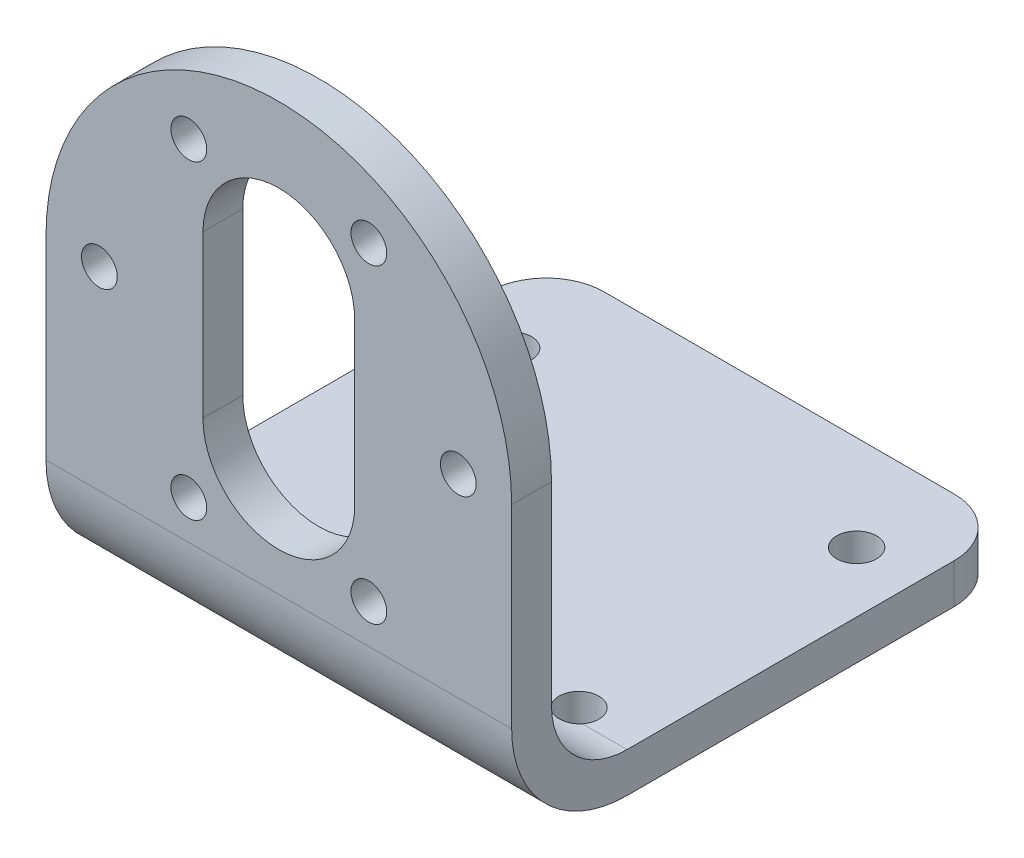
ISO-10303-21;
HEADER;
FILE_DESCRIPTION(('STEP AP214'),'2;1');
FILE_NAME('part.step','',(''),(''),'','','');
FILE_SCHEMA(('AUTOMOTIVE_DESIGN { 1 0 10303 214 1 1 1 1 }'));
ENDSEC;
DATA;
#1=APPLICATION_CONTEXT('core data for automotive mechanical design processes');
#2=APPLICATION_PROTOCOL_DEFINITION('international standard','automotive_design',2000,#1);
#3=PRODUCT_CONTEXT('',#1,'mechanical');
#4=PRODUCT('Part','Part','',(#3));
#5=PRODUCT_RELATED_PRODUCT_CATEGORY('part','',(#4));
#6=PRODUCT_DEFINITION_FORMATION('','',#4);
#7=PRODUCT_DEFINITION_CONTEXT('part definition',#1,'design');
#8=PRODUCT_DEFINITION('design','',#6,#7);
#9=PRODUCT_DEFINITION_SHAPE('','',#8);
#10=(LENGTH_UNIT() NAMED_UNIT(*) SI_UNIT(.MILLI.,.METRE.));
#11=(NAMED_UNIT(*) PLANE_ANGLE_UNIT() SI_UNIT($,.RADIAN.));
#12=(NAMED_UNIT(*) SI_UNIT($,.STERADIAN.) SOLID_ANGLE_UNIT());
#13=UNCERTAINTY_MEASURE_WITH_UNIT(LENGTH_MEASURE(1.E-05),#10,'distance_accuracy_value','');
#14=(GEOMETRIC_REPRESENTATION_CONTEXT(3) GLOBAL_UNCERTAINTY_ASSIGNED_CONTEXT((#13)) GLOBAL_UNIT_ASSIGNED_CONTEXT((#10,
#11,#12)) REPRESENTATION_CONTEXT('',''));
#15=CARTESIAN_POINT('',(0.,0.,0.));
#16=DIRECTION('',(0.,0.,1.));
#17=DIRECTION('',(1.,0.,0.));
#18=AXIS2_PLACEMENT_3D('',#15,#16,#17);
#19=CARTESIAN_POINT('',(-47.1412127925836,47.,50.783023222912));
#20=DIRECTION('',(0.,0.,-1.));
#21=DIRECTION('',(-1.,0.,0.));
#22=AXIS2_PLACEMENT_3D('',#19,#20,#21);
#23=PLANE('',#22);
#24=CARTESIAN_POINT('',(-19.1662127925836,13.3727697016443,50.783023222912));
#25=DIRECTION('',(0.,0.,1.));
#26=DIRECTION('',(1.,0.,0.));
#27=AXIS2_PLACEMENT_3D('',#24,#25,#26);
#28=CIRCLE('',#27,1.55);
#29=CARTESIAN_POINT('',(-17.6162127925836,13.3727697016443,50.783023222912));
#30=VERTEX_POINT('',#29);
#31=EDGE_CURVE('E438',#30,#30,#28,.F.);
#32=ORIENTED_EDGE('',*,*,#31,.T.);
#33=EDGE_LOOP('',(#32));
#34=FACE_BOUND('',#33,.T.);
#35=CARTESIAN_POINT('',(-42.5162127925836,26.825,50.783023222912));
#36=DIRECTION('',(0.,0.,1.));
#37=DIRECTION('',(1.,0.,0.));
#38=AXIS2_PLACEMENT_3D('',#35,#36,#37);
#39=CIRCLE('',#38,1.54999999999999);
#40=CARTESIAN_POINT('',(-40.9662127925836,26.825,50.783023222912));
#41=VERTEX_POINT('',#40);
#42=EDGE_CURVE('E435',#41,#41,#39,.T.);
#43=ORIENTED_EDGE('',*,*,#42,.F.);
#44=EDGE_LOOP('',(#43));
#45=FACE_BOUND('',#44,.T.);
#46=CARTESIAN_POINT('',(-19.1662127925836,40.2772302983557,50.783023222912));
#47=DIRECTION('',(0.,0.,1.));
#48=DIRECTION('',(1.,0.,0.));
#49=AXIS2_PLACEMENT_3D('',#46,#47,#48);
#50=CIRCLE('',#49,1.55);
#51=CARTESIAN_POINT('',(-17.6162127925836,40.2772302983557,50.783023222912));
#52=VERTEX_POINT('',#51);
#53=EDGE_CURVE('E430',#52,#52,#50,.T.);
#54=ORIENTED_EDGE('',*,*,#53,.F.);
#55=EDGE_LOOP('',(#54));
#56=FACE_BOUND('',#55,.T.);
#57=CARTESIAN_POINT('',(-34.7662127925836,13.3727697016443,50.783023222912));
#58=DIRECTION('',(0.,0.,1.));
#59=DIRECTION('',(1.,0.,0.));
#60=AXIS2_PLACEMENT_3D('',#57,#58,#59);
#61=CIRCLE('',#60,1.55);
#62=CARTESIAN_POINT('',(-33.2162127925836,13.3727697016443,50.783023222912));
#63=VERTEX_POINT('',#62);
#64=EDGE_CURVE('E268',#63,#63,#61,.F.);
#65=ORIENTED_EDGE('',*,*,#64,.T.);
#66=EDGE_LOOP('',(#65));
#67=FACE_BOUND('',#66,.T.);
#68=CARTESIAN_POINT('',(-26.9662127925836,19.945,50.783023222912));
#69=DIRECTION('',(0.,0.,1.));
#70=DIRECTION('',(1.,0.,0.));
#71=AXIS2_PLACEMENT_3D('',#68,#69,#70);
#72=CIRCLE('',#71,6.575);
#73=CARTESIAN_POINT('',(-33.5412127925836,19.945,50.783023222912));
#74=VERTEX_POINT('',#73);
#75=CARTESIAN_POINT('',(-20.3912127925836,19.945,50.783023222912));
#76=VERTEX_POINT('',#75);
#77=EDGE_CURVE('E175',#74,#76,#72,.T.);
#78=ORIENTED_EDGE('',*,*,#77,.F.);
#79=DIRECTION('',(0.,-1.,0.));
#80=VECTOR('',#79,1.);
#81=CARTESIAN_POINT('',(-33.5412127925836,0.,50.783023222912));
#82=LINE('',#81,#80);
#83=CARTESIAN_POINT('',(-33.5412127925836,33.925,50.783023222912));
#84=VERTEX_POINT('',#83);
#85=EDGE_CURVE('E53',#84,#74,#82,.T.);
#86=ORIENTED_EDGE('',*,*,#85,.F.);
#87=CARTESIAN_POINT('',(-26.9662127925836,33.925,50.783023222912));
#88=DIRECTION('',(0.,0.,1.));
#89=DIRECTION('',(1.,0.,0.));
#90=AXIS2_PLACEMENT_3D('',#87,#88,#89);
#91=CIRCLE('',#90,6.57500000000001);
#92=CARTESIAN_POINT('',(-20.3912127925836,33.925,50.783023222912));
#93=VERTEX_POINT('',#92);
#94=EDGE_CURVE('E181',#93,#84,#91,.T.);
#95=ORIENTED_EDGE('',*,*,#94,.F.);
#96=DIRECTION('',(0.,-1.,0.));
#97=VECTOR('',#96,1.);
#98=CARTESIAN_POINT('',(-20.3912127925836,0.,50.783023222912));
#99=LINE('',#98,#97);
#100=EDGE_CURVE('E166',#93,#76,#99,.T.);
#101=ORIENTED_EDGE('',*,*,#100,.T.);
#102=EDGE_LOOP('',(#78,#86,#95,#101));
#103=FACE_BOUND('',#102,.T.);
#104=DIRECTION('',(0.,-1.,0.));
#105=VECTOR('',#104,1.);
#106=CARTESIAN_POINT('',(-47.1412127925836,47.,50.783023222912));
#107=LINE('',#106,#105);
#108=CARTESIAN_POINT('',(-47.1412127925836,26.825,50.783023222912));
#109=VERTEX_POINT('',#108);
#110=CARTESIAN_POINT('',(-47.1412127925836,10.,50.783023222912));
#111=VERTEX_POINT('',#110);
#112=EDGE_CURVE('E326',#109,#111,#107,.T.);
#113=ORIENTED_EDGE('',*,*,#112,.T.);
#114=DIRECTION('',(1.,0.,0.));
#115=VECTOR('',#114,1.);
#116=CARTESIAN_POINT('',(-47.1412127925836,10.,50.783023222912));
#117=LINE('',#116,#115);
#118=CARTESIAN_POINT('',(-6.79121279258359,10.,50.783023222912));
#119=VERTEX_POINT('',#118);
#120=EDGE_CURVE('E321',#111,#119,#117,.T.);
#121=ORIENTED_EDGE('',*,*,#120,.T.);
#122=DIRECTION('',(0.,-1.,0.));
#123=VECTOR('',#122,1.);
#124=CARTESIAN_POINT('',(-6.79121279258359,47.,50.783023222912));
#125=LINE('',#124,#123);
#126=CARTESIAN_POINT('',(-6.79121279258359,26.825,50.783023222912));
#127=VERTEX_POINT('',#126);
#128=EDGE_CURVE('E329',#127,#119,#125,.T.);
#129=ORIENTED_EDGE('',*,*,#128,.F.);
#130=CARTESIAN_POINT('',(-26.9662127925836,26.825,50.783023222912));
#131=DIRECTION('',(0.,0.,1.));
#132=DIRECTION('',(1.,0.,0.));
#133=AXIS2_PLACEMENT_3D('',#130,#131,#132);
#134=CIRCLE('',#133,20.175);
#135=EDGE_CURVE('E343',#127,#109,#134,.T.);
#136=ORIENTED_EDGE('',*,*,#135,.T.);
#137=EDGE_LOOP('',(#113,#121,#129,#136));
#138=FACE_BOUND('',#137,.T.);
#139=CARTESIAN_POINT('',(-34.7662127925836,40.2772302983557,50.783023222912));
#140=DIRECTION('',(0.,0.,1.));
#141=DIRECTION('',(1.,0.,0.));
#142=AXIS2_PLACEMENT_3D('',#139,#140,#141);
#143=CIRCLE('',#142,1.55);
#144=CARTESIAN_POINT('',(-33.2162127925836,40.2772302983557,50.783023222912));
#145=VERTEX_POINT('',#144);
#146=EDGE_CURVE('E432',#145,#145,#143,.T.);
#147=ORIENTED_EDGE('',*,*,#146,.F.);
#148=EDGE_LOOP('',(#147));
#149=FACE_BOUND('',#148,.T.);
#150=CARTESIAN_POINT('',(-11.4162127925836,26.825,50.783023222912));
#151=DIRECTION('',(0.,0.,1.));
#152=DIRECTION('',(1.,0.,0.));
#153=AXIS2_PLACEMENT_3D('',#150,#151,#152);
#154=CIRCLE('',#153,1.55);
#155=CARTESIAN_POINT('',(-9.8662127925836,26.825,50.783023222912));
#156=VERTEX_POINT('',#155);
#157=EDGE_CURVE('E441',#156,#156,#154,.T.);
#158=ORIENTED_EDGE('',*,*,#157,.F.);
#159=EDGE_LOOP('',(#158));
#160=FACE_BOUND('',#159,.T.);
#161=ADVANCED_FACE('F36',(#34,#45,#56,#67,#103,#138,#149,#160),#23,.F.);
#162=CARTESIAN_POINT('',(54.8587872074164,0.,47.3330232229119));
#163=DIRECTION('',(0.,0.,1.));
#164=DIRECTION('',(1.,0.,0.));
#165=AXIS2_PLACEMENT_3D('',#162,#163,#164);
#166=PLANE('',#165);
#167=CARTESIAN_POINT('',(-19.1662127925836,13.3727697016443,47.333023222912));
#168=DIRECTION('',(0.,0.,1.));
#169=DIRECTION('',(1.,0.,0.));
#170=AXIS2_PLACEMENT_3D('',#167,#168,#169);
#171=CIRCLE('',#170,1.55);
#172=CARTESIAN_POINT('',(-17.6162127925836,13.3727697016443,47.333023222912));
#173=VERTEX_POINT('',#172);
#174=EDGE_CURVE('E40',#173,#173,#171,.F.);
#175=ORIENTED_EDGE('',*,*,#174,.F.);
#176=EDGE_LOOP('',(#175));
#177=FACE_BOUND('',#176,.T.);
#178=CARTESIAN_POINT('',(-42.5162127925836,26.825,47.333023222912));
#179=DIRECTION('',(0.,0.,1.));
#180=DIRECTION('',(1.,0.,0.));
#181=AXIS2_PLACEMENT_3D('',#178,#179,#180);
#182=CIRCLE('',#181,1.54999999999999);
#183=CARTESIAN_POINT('',(-40.9662127925836,26.825,47.333023222912));
#184=VERTEX_POINT('',#183);
#185=EDGE_CURVE('E241',#184,#184,#182,.T.);
#186=ORIENTED_EDGE('',*,*,#185,.T.);
#187=EDGE_LOOP('',(#186));
#188=FACE_BOUND('',#187,.T.);
#189=CARTESIAN_POINT('',(-19.1662127925836,40.2772302983557,47.333023222912));
#190=DIRECTION('',(0.,0.,1.));
#191=DIRECTION('',(1.,0.,0.));
#192=AXIS2_PLACEMENT_3D('',#189,#190,#191);
#193=CIRCLE('',#192,1.55);
#194=CARTESIAN_POINT('',(-17.6162127925836,40.2772302983557,47.333023222912));
#195=VERTEX_POINT('',#194);
#196=EDGE_CURVE('E245',#195,#195,#193,.T.);
#197=ORIENTED_EDGE('',*,*,#196,.T.);
#198=EDGE_LOOP('',(#197));
#199=FACE_BOUND('',#198,.T.);
#200=CARTESIAN_POINT('',(-34.7662127925836,13.3727697016443,47.333023222912));
#201=DIRECTION('',(0.,0.,1.));
#202=DIRECTION('',(1.,0.,0.));
#203=AXIS2_PLACEMENT_3D('',#200,#201,#202);
#204=CIRCLE('',#203,1.55);
#205=CARTESIAN_POINT('',(-33.2162127925836,13.3727697016443,47.333023222912));
#206=VERTEX_POINT('',#205);
#207=EDGE_CURVE('E249',#206,#206,#204,.F.);
#208=ORIENTED_EDGE('',*,*,#207,.F.);
#209=EDGE_LOOP('',(#208));
#210=FACE_BOUND('',#209,.T.);
#211=CARTESIAN_POINT('',(-26.9662127925836,33.925,47.333023222912));
#212=DIRECTION('',(0.,0.,1.));
#213=DIRECTION('',(1.,0.,0.));
#214=AXIS2_PLACEMENT_3D('',#211,#212,#213);
#215=CIRCLE('',#214,6.57500000000001);
#216=CARTESIAN_POINT('',(-20.3912127925836,33.925,47.333023222912));
#217=VERTEX_POINT('',#216);
#218=CARTESIAN_POINT('',(-33.5412127925836,33.925,47.333023222912));
#219=VERTEX_POINT('',#218);
#220=EDGE_CURVE('E45',#217,#219,#215,.T.);
#221=ORIENTED_EDGE('',*,*,#220,.T.);
#222=DIRECTION('',(0.,-1.,0.));
#223=VECTOR('',#222,1.);
#224=CARTESIAN_POINT('',(-33.5412127925836,0.,47.333023222912));
#225=LINE('',#224,#223);
#226=CARTESIAN_POINT('',(-33.5412127925836,19.945,47.333023222912));
#227=VERTEX_POINT('',#226);
#228=EDGE_CURVE('E11',#219,#227,#225,.T.);
#229=ORIENTED_EDGE('',*,*,#228,.T.);
#230=CARTESIAN_POINT('',(-26.9662127925836,19.945,47.333023222912));
#231=DIRECTION('',(0.,0.,1.));
#232=DIRECTION('',(1.,0.,0.));
#233=AXIS2_PLACEMENT_3D('',#230,#231,#232);
#234=CIRCLE('',#233,6.575);
#235=CARTESIAN_POINT('',(-20.3912127925836,19.945,47.333023222912));
#236=VERTEX_POINT('',#235);
#237=EDGE_CURVE('E272',#227,#236,#234,.T.);
#238=ORIENTED_EDGE('',*,*,#237,.T.);
#239=DIRECTION('',(0.,-1.,0.));
#240=VECTOR('',#239,1.);
#241=CARTESIAN_POINT('',(-20.3912127925836,0.,47.333023222912));
#242=LINE('',#241,#240);
#243=EDGE_CURVE('E169',#217,#236,#242,.T.);
#244=ORIENTED_EDGE('',*,*,#243,.F.);
#245=EDGE_LOOP('',(#221,#229,#238,#244));
#246=FACE_BOUND('',#245,.T.);
#247=DIRECTION('',(-1.,0.,0.));
#248=VECTOR('',#247,1.);
#249=CARTESIAN_POINT('',(54.8587872074164,10.,47.3330232229119));
#250=LINE('',#249,#248);
#251=CARTESIAN_POINT('',(-6.79121279258359,10.,47.333023222912));
#252=VERTEX_POINT('',#251);
#253=CARTESIAN_POINT('',(-47.1412127925836,10.,47.333023222912));
#254=VERTEX_POINT('',#253);
#255=EDGE_CURVE('E254',#252,#254,#250,.T.);
#256=ORIENTED_EDGE('',*,*,#255,.T.);
#257=DIRECTION('',(0.,1.,0.));
#258=VECTOR('',#257,1.);
#259=CARTESIAN_POINT('',(-47.1412127925836,0.,47.333023222912));
#260=LINE('',#259,#258);
#261=CARTESIAN_POINT('',(-47.1412127925836,26.825,47.333023222912));
#262=VERTEX_POINT('',#261);
#263=EDGE_CURVE('E361',#254,#262,#260,.T.);
#264=ORIENTED_EDGE('',*,*,#263,.T.);
#265=CARTESIAN_POINT('',(-26.9662127925836,26.825,47.333023222912));
#266=DIRECTION('',(0.,0.,1.));
#267=DIRECTION('',(1.,0.,0.));
#268=AXIS2_PLACEMENT_3D('',#265,#266,#267);
#269=CIRCLE('',#268,20.175);
#270=CARTESIAN_POINT('',(-6.79121279258359,26.825,47.333023222912));
#271=VERTEX_POINT('',#270);
#272=EDGE_CURVE('E310',#262,#271,#269,.F.);
#273=ORIENTED_EDGE('',*,*,#272,.T.);
#274=DIRECTION('',(0.,1.,0.));
#275=VECTOR('',#274,1.);
#276=CARTESIAN_POINT('',(-6.7912127925836,47.,47.333023222912));
#277=LINE('',#276,#275);
#278=EDGE_CURVE('E349',#252,#271,#277,.T.);
#279=ORIENTED_EDGE('',*,*,#278,.F.);
#280=EDGE_LOOP('',(#256,#264,#273,#279));
#281=FACE_BOUND('',#280,.T.);
#282=CARTESIAN_POINT('',(-34.7662127925836,40.2772302983557,47.333023222912));
#283=DIRECTION('',(0.,0.,1.));
#284=DIRECTION('',(1.,0.,0.));
#285=AXIS2_PLACEMENT_3D('',#282,#283,#284);
#286=CIRCLE('',#285,1.55);
#287=CARTESIAN_POINT('',(-33.2162127925836,40.2772302983557,47.333023222912));
#288=VERTEX_POINT('',#287);
#289=EDGE_CURVE('E259',#288,#288,#286,.T.);
#290=ORIENTED_EDGE('',*,*,#289,.T.);
#291=EDGE_LOOP('',(#290));
#292=FACE_BOUND('',#291,.T.);
#293=CARTESIAN_POINT('',(-11.4162127925836,26.825,47.333023222912));
#294=DIRECTION('',(0.,0.,1.));
#295=DIRECTION('',(1.,0.,0.));
#296=AXIS2_PLACEMENT_3D('',#293,#294,#295);
#297=CIRCLE('',#296,1.55);
#298=CARTESIAN_POINT('',(-9.8662127925836,26.825,47.333023222912));
#299=VERTEX_POINT('',#298);
#300=EDGE_CURVE('E262',#299,#299,#297,.T.);
#301=ORIENTED_EDGE('',*,*,#300,.T.);
#302=EDGE_LOOP('',(#301));
#303=FACE_BOUND('',#302,.T.);
#304=ADVANCED_FACE('F224',(#177,#188,#199,#210,#246,#281,#292,#303),#166,.F.);
#305=CARTESIAN_POINT('',(-47.1412127925836,10.,40.783023222912));
#306=DIRECTION('',(1.,0.,0.));
#307=DIRECTION('',(0.,0.,-1.));
#308=AXIS2_PLACEMENT_3D('',#305,#306,#307);
#309=CYLINDRICAL_SURFACE('',#308,10.);
#310=DIRECTION('',(1.,0.,0.));
#311=VECTOR('',#310,1.);
#312=CARTESIAN_POINT('',(0.,0.,40.783023222912));
#313=LINE('',#312,#311);
#314=CARTESIAN_POINT('',(-43.2784362563963,0.,40.783023222912));
#315=VERTEX_POINT('',#314);
#316=CARTESIAN_POINT('',(-47.1412127925836,0.,40.783023222912));
#317=VERTEX_POINT('',#316);
#318=EDGE_CURVE('E318',#315,#317,#313,.F.);
#319=ORIENTED_EDGE('',*,*,#318,.F.);
#320=CARTESIAN_POINT('',(-43.2784362563963,0.,40.783023222912));
#321=CARTESIAN_POINT('',(-43.2486359399709,-4.4349836473621E-07,40.8214603242163));
#322=CARTESIAN_POINT('',(-43.2172287872784,0.000221662332903279,40.8586212397988));
#323=CARTESIAN_POINT('',(-43.1514043101819,0.0010186956629008,40.9301644796071));
#324=CARTESIAN_POINT('',(-43.1169872222953,0.00159359546079015,40.9645470217466));
#325=CARTESIAN_POINT('',(-43.0096338534374,0.00370689110784972,41.0630910128974));
#326=CARTESIAN_POINT('',(-42.9324984911893,0.0056344754400285,41.1227736432645));
#327=CARTESIAN_POINT('',(-42.7693296609276,0.00977993356184888,41.228345263273));
#328=CARTESIAN_POINT('',(-42.6832930344563,0.0119979104668324,41.2742293340198));
#329=CARTESIAN_POINT('',(-42.5047417406216,0.0160643864272017,41.3509225745123));
#330=CARTESIAN_POINT('',(-42.4122283105362,0.017912955792662,41.3817346145671));
#331=CARTESIAN_POINT('',(-42.2232265987625,0.0207581801391745,41.4274329016619));
#332=CARTESIAN_POINT('',(-42.12673395157,0.0217538719032161,41.4423011469684));
#333=CARTESIAN_POINT('',(-41.9326057116994,0.0226429764720122,41.4556247462691));
#334=CARTESIAN_POINT('',(-41.8349700052027,0.0225362785590523,41.4540784516805));
#335=CARTESIAN_POINT('',(-41.6415763854825,0.021247958445125,41.4346366721685));
#336=CARTESIAN_POINT('',(-41.545814678288,0.0200688027684255,41.4167787017401));
#337=CARTESIAN_POINT('',(-41.3586275956189,0.0169319205563948,41.3652693387677));
#338=CARTESIAN_POINT('',(-41.2672030897992,0.0149740386105347,41.3316147934571));
#339=CARTESIAN_POINT('',(-41.0911541003926,0.0107972095030289,41.24941231941));
#340=CARTESIAN_POINT('',(-41.0065411024623,0.0085778363148311,41.2008398734209));
#341=CARTESIAN_POINT('',(-40.8467183970987,0.00456685197800229,41.0901995387781));
#342=CARTESIAN_POINT('',(-40.7714972938275,0.0027747199777472,41.0281482605263));
#343=CARTESIAN_POINT('',(-40.6737041799865,0.00108006920567029,40.9325906426761));
#344=CARTESIAN_POINT('',(-40.6463021380582,0.000686824269006335,40.9039027447807));
#345=CARTESIAN_POINT('',(-40.5935784639084,0.000146949433395791,40.8447642573952));
#346=CARTESIAN_POINT('',(-40.5682532244093,-1.17077590246397E-07,40.8143168878988));
#347=CARTESIAN_POINT('',(-40.5439893287709,0.,40.783023222912));
#348=B_SPLINE_CURVE_WITH_KNOTS('',3,(#320,#321,#322,#323,#324,#325,#326,#327,#328,#329,#330,
#331,#332,#333,#334,#335,#336,#337,#338,#339,#340,#341,#342,#343,#344,#345,#346,#347),
.UNSPECIFIED.,.F.,.F.,(4,2,2,2,2,2,2,2,2,2,2,2,2,4),(0.,0.145817200628919,0.291622953380003,
0.5827663273497,0.874013365077776,1.1652049162671,1.45672489938087,1.74827416137905,
2.03915458593045,2.33009309068699,2.62151232879096,2.91257445855667,3.03152037022583,
3.1502550998775),.UNSPECIFIED.);
#349=CARTESIAN_POINT('',(-40.5439893287709,0.,40.783023222912));
#350=VERTEX_POINT('',#349);
#351=EDGE_CURVE('E367',#315,#350,#348,.T.);
#352=ORIENTED_EDGE('',*,*,#351,.T.);
#353=CARTESIAN_POINT('',(-13.3884362563963,0.,40.783023222912));
#354=VERTEX_POINT('',#353);
#355=EDGE_CURVE('E317',#354,#350,#313,.F.);
#356=ORIENTED_EDGE('',*,*,#355,.F.);
#357=CARTESIAN_POINT('',(-13.3884362563963,0.,40.783023222912));
#358=CARTESIAN_POINT('',(-13.3586359399709,-4.43498364004496E-07,40.8214603242163));
#359=CARTESIAN_POINT('',(-13.3272287872784,0.000221662332904452,40.8586212397988));
#360=CARTESIAN_POINT('',(-13.261404310182,0.0010186956629024,40.9301644796071));
#361=CARTESIAN_POINT('',(-13.2269872222954,0.00159359546079172,40.9645470217466));
#362=CARTESIAN_POINT('',(-13.1196338534375,0.00370689110785085,41.0630910128974));
#363=CARTESIAN_POINT('',(-13.0424984911893,0.00563447544002885,41.1227736432645));
#364=CARTESIAN_POINT('',(-12.8793296609276,0.00977993356184872,41.228345263273));
#365=CARTESIAN_POINT('',(-12.7932930344563,0.0119979104668325,41.2742293340198));
#366=CARTESIAN_POINT('',(-12.6147417406216,0.016064386427203,41.3509225745122));
#367=CARTESIAN_POINT('',(-12.5222283105362,0.0179129557926641,41.3817346145671));
#368=CARTESIAN_POINT('',(-12.3332265987625,0.0207581801391763,41.4274329016619));
#369=CARTESIAN_POINT('',(-12.23673395157,0.0217538719032167,41.4423011469684));
#370=CARTESIAN_POINT('',(-12.0426057116995,0.0226429764720127,41.4556247462691));
#371=CARTESIAN_POINT('',(-11.9449700052027,0.022536278559054,41.4540784516805));
#372=CARTESIAN_POINT('',(-11.7515763854825,0.0212479584451273,41.4346366721685));
#373=CARTESIAN_POINT('',(-11.655814678288,0.0200688027684272,41.4167787017401));
#374=CARTESIAN_POINT('',(-11.4686275956189,0.0169319205563954,41.3652693387677));
#375=CARTESIAN_POINT('',(-11.3772030897992,0.0149740386105346,41.3316147934571));
#376=CARTESIAN_POINT('',(-11.2011541003926,0.0107972095030294,41.24941231941));
#377=CARTESIAN_POINT('',(-11.1165411024623,0.00857783631483298,41.2008398734209));
#378=CARTESIAN_POINT('',(-10.9567183970987,0.00456685197800412,41.0901995387781));
#379=CARTESIAN_POINT('',(-10.8814972938275,0.00277471997774761,41.0281482605263));
#380=CARTESIAN_POINT('',(-10.7837041799865,0.00108006920567024,40.9325906426761));
#381=CARTESIAN_POINT('',(-10.7563021380582,0.00068682426900633,40.9039027447807));
#382=CARTESIAN_POINT('',(-10.7035784639084,0.000146949433395858,40.8447642573952));
#383=CARTESIAN_POINT('',(-10.6782532244093,-1.17077590163831E-07,40.8143168878988));
#384=CARTESIAN_POINT('',(-10.6539893287709,0.,40.783023222912));
#385=B_SPLINE_CURVE_WITH_KNOTS('',3,(#357,#358,#359,#360,#361,#362,#363,#364,#365,#366,#367,
#368,#369,#370,#371,#372,#373,#374,#375,#376,#377,#378,#379,#380,#381,#382,#383,#384),
.UNSPECIFIED.,.F.,.F.,(4,2,2,2,2,2,2,2,2,2,2,2,2,4),(0.,0.145817200628917,0.29162295337999,
0.582766327349691,0.874013365077768,1.16520491626709,1.45672489938085,1.74827416137904,
2.03915458593043,2.33009309068698,2.62151232879094,2.91257445855666,3.03152037022582,
3.1502550998775),.UNSPECIFIED.);
#386=CARTESIAN_POINT('',(-10.6539893287709,0.,40.783023222912));
#387=VERTEX_POINT('',#386);
#388=EDGE_CURVE('E198',#354,#387,#385,.T.);
#389=ORIENTED_EDGE('',*,*,#388,.T.);
#390=CARTESIAN_POINT('',(-6.7912127925836,0.,40.783023222912));
#391=VERTEX_POINT('',#390);
#392=EDGE_CURVE('E314',#391,#387,#313,.F.);
#393=ORIENTED_EDGE('',*,*,#392,.F.);
#394=CARTESIAN_POINT('',(-6.79121279258359,10.,40.783023222912));
#395=DIRECTION('',(-1.,0.,0.));
#396=DIRECTION('',(0.,0.,1.));
#397=AXIS2_PLACEMENT_3D('',#394,#395,#396);
#398=CIRCLE('',#397,10.);
#399=EDGE_CURVE('E319',#119,#391,#398,.F.);
#400=ORIENTED_EDGE('',*,*,#399,.F.);
#401=ORIENTED_EDGE('',*,*,#120,.F.);
#402=CARTESIAN_POINT('',(-47.1412127925836,10.,40.783023222912));
#403=DIRECTION('',(1.,0.,0.));
#404=DIRECTION('',(0.,0.,-1.));
#405=AXIS2_PLACEMENT_3D('',#402,#403,#404);
#406=CIRCLE('',#405,10.);
#407=EDGE_CURVE('E312',#317,#111,#406,.F.);
#408=ORIENTED_EDGE('',*,*,#407,.F.);
#409=EDGE_LOOP('',(#319,#352,#356,#389,#393,#400,#401,#408));
#410=FACE_BOUND('',#409,.T.);
#411=ADVANCED_FACE('F226',(#410),#309,.T.);
#412=CARTESIAN_POINT('',(54.8587872074164,10.,40.783023222912));
#413=DIRECTION('',(-1.,0.,0.));
#414=DIRECTION('',(0.,0.,1.));
#415=AXIS2_PLACEMENT_3D('',#412,#413,#414);
#416=CYLINDRICAL_SURFACE('',#415,6.55);
#417=CARTESIAN_POINT('',(-43.2784362563963,3.45,40.783023222912));
#418=CARTESIAN_POINT('',(-43.2486649030444,3.44999934867349,40.8214232101327));
#419=CARTESIAN_POINT('',(-43.2172902209575,3.45033775649313,40.8585485309627));
#420=CARTESIAN_POINT('',(-43.1515404880796,3.45155234711172,40.9300223959799));
#421=CARTESIAN_POINT('',(-43.1171657950523,3.4524284658614,40.9643712703312));
#422=CARTESIAN_POINT('',(-43.0099569119221,3.4556495514347,41.0628179147159));
#423=CARTESIAN_POINT('',(-42.9329391434865,3.45858816576504,41.1224428225017));
#424=CARTESIAN_POINT('',(-42.7700443143619,3.46491250386588,41.2279283458496));
#425=CARTESIAN_POINT('',(-42.6841653050849,3.46829832602347,41.2737859252697));
#426=CARTESIAN_POINT('',(-42.5059278443798,3.47451325501785,41.3504810031661));
#427=CARTESIAN_POINT('',(-42.4135705615224,3.47734246191005,41.3813212025926));
#428=CARTESIAN_POINT('',(-42.2247208263061,3.48170828002287,41.4271593411075));
#429=CARTESIAN_POINT('',(-42.1282182748401,3.48324152138179,41.4421160044016));
#430=CARTESIAN_POINT('',(-41.9340504787137,3.48461989976377,41.4556076068657));
#431=CARTESIAN_POINT('',(-41.8363851496024,3.48446491341682,41.4541413459035));
#432=CARTESIAN_POINT('',(-41.6432092488083,3.48251007467015,41.4348786711695));
#433=CARTESIAN_POINT('',(-41.5476901567274,3.48071871713345,41.4171665920683));
#434=CARTESIAN_POINT('',(-41.360958528036,3.47594847703818,41.3660360946161));
#435=CARTESIAN_POINT('',(-41.2697470123892,3.47296931451527,41.3326139730928));
#436=CARTESIAN_POINT('',(-41.0939340886157,3.4666029712209,41.2508939730243));
#437=CARTESIAN_POINT('',(-41.0093543826965,3.46321453608974,41.2025496178487));
#438=CARTESIAN_POINT('',(-40.8495367810102,3.45707866045226,41.0923795263331));
#439=CARTESIAN_POINT('',(-40.7742873177906,3.45433042244906,41.0305707505484));
#440=CARTESIAN_POINT('',(-40.6759167088539,3.45169993130762,40.9348709782518));
#441=CARTESIAN_POINT('',(-40.6480286032222,3.45108135877871,40.9057707295625));
#442=CARTESIAN_POINT('',(-40.5943938538111,3.45023162529874,40.8457439712088));
#443=CARTESIAN_POINT('',(-40.5686436235682,3.44999980253179,40.814820675295));
#444=CARTESIAN_POINT('',(-40.5439893287709,3.45,40.783023222912));
#445=B_SPLINE_CURVE_WITH_KNOTS('',3,(#417,#418,#419,#420,#421,#422,#423,#424,#425,#426,#427,
#428,#429,#430,#431,#432,#433,#434,#435,#436,#437,#438,#439,#440,#441,#442,#443,#444),
.UNSPECIFIED.,.F.,.F.,(4,2,2,2,2,2,2,2,2,2,2,2,2,4),(0.,0.145674126204746,0.291330903847856,
0.582167706488014,0.873068601032213,1.16391715626718,1.45551969013826,1.74714353348516,
2.03726202612376,2.32744893983427,2.61854894557612,2.90928436386592,3.03013527599317,
3.15077917208322),.UNSPECIFIED.);
#446=CARTESIAN_POINT('',(-43.2784362563963,3.44999999999999,40.783023222912));
#447=VERTEX_POINT('',#446);
#448=CARTESIAN_POINT('',(-40.5439893287709,3.44999999999999,40.783023222912));
#449=VERTEX_POINT('',#448);
#450=EDGE_CURVE('E374',#447,#449,#445,.T.);
#451=ORIENTED_EDGE('',*,*,#450,.F.);
#452=DIRECTION('',(-1.,0.,0.));
#453=VECTOR('',#452,1.);
#454=CARTESIAN_POINT('',(54.8587872074164,3.45,40.783023222912));
#455=LINE('',#454,#453);
#456=CARTESIAN_POINT('',(-47.1412127925836,3.45,40.783023222912));
#457=VERTEX_POINT('',#456);
#458=EDGE_CURVE('E354',#447,#457,#455,.T.);
#459=ORIENTED_EDGE('',*,*,#458,.T.);
#460=CARTESIAN_POINT('',(-47.1412127925836,10.,40.783023222912));
#461=DIRECTION('',(-1.,0.,0.));
#462=DIRECTION('',(0.,0.,1.));
#463=AXIS2_PLACEMENT_3D('',#460,#461,#462);
#464=CIRCLE('',#463,6.55);
#465=EDGE_CURVE('E363',#457,#254,#464,.T.);
#466=ORIENTED_EDGE('',*,*,#465,.T.);
#467=ORIENTED_EDGE('',*,*,#255,.F.);
#468=CARTESIAN_POINT('',(-6.79121279258359,10.,40.783023222912));
#469=DIRECTION('',(-1.,0.,0.));
#470=DIRECTION('',(0.,0.,1.));
#471=AXIS2_PLACEMENT_3D('',#468,#469,#470);
#472=CIRCLE('',#471,6.55);
#473=CARTESIAN_POINT('',(-6.7912127925836,3.45,40.783023222912));
#474=VERTEX_POINT('',#473);
#475=EDGE_CURVE('E307',#474,#252,#472,.T.);
#476=ORIENTED_EDGE('',*,*,#475,.F.);
#477=CARTESIAN_POINT('',(-10.6539893287709,3.44999999999999,40.783023222912));
#478=VERTEX_POINT('',#477);
#479=EDGE_CURVE('E352',#474,#478,#455,.T.);
#480=ORIENTED_EDGE('',*,*,#479,.T.);
#481=CARTESIAN_POINT('',(-13.3884362563963,3.45,40.783023222912));
#482=CARTESIAN_POINT('',(-13.3586649030444,3.44999934867349,40.8214232101327));
#483=CARTESIAN_POINT('',(-13.3272902209575,3.45033775649313,40.8585485309627));
#484=CARTESIAN_POINT('',(-13.2615404880797,3.45155234711172,40.9300223959798));
#485=CARTESIAN_POINT('',(-13.2271657950523,3.4524284658614,40.9643712703311));
#486=CARTESIAN_POINT('',(-13.1199569119221,3.4556495514347,41.0628179147159));
#487=CARTESIAN_POINT('',(-13.0429391434865,3.45858816576504,41.1224428225017));
#488=CARTESIAN_POINT('',(-12.8800443143619,3.46491250386588,41.2279283458496));
#489=CARTESIAN_POINT('',(-12.7941653050849,3.46829832602347,41.2737859252697));
#490=CARTESIAN_POINT('',(-12.6159278443798,3.47451325501785,41.3504810031661));
#491=CARTESIAN_POINT('',(-12.5235705615224,3.47734246191005,41.3813212025926));
#492=CARTESIAN_POINT('',(-12.3347208263061,3.48170828002287,41.4271593411075));
#493=CARTESIAN_POINT('',(-12.2382182748401,3.48324152138179,41.4421160044016));
#494=CARTESIAN_POINT('',(-12.0440504787137,3.48461989976377,41.4556076068657));
#495=CARTESIAN_POINT('',(-11.9463851496024,3.48446491341683,41.4541413459035));
#496=CARTESIAN_POINT('',(-11.7532092488083,3.48251007467015,41.4348786711695));
#497=CARTESIAN_POINT('',(-11.6576901567275,3.48071871713346,41.4171665920683));
#498=CARTESIAN_POINT('',(-11.470958528036,3.47594847703818,41.3660360946161));
#499=CARTESIAN_POINT('',(-11.3797470123892,3.47296931451527,41.3326139730928));
#500=CARTESIAN_POINT('',(-11.2039340886157,3.4666029712209,41.2508939730243));
#501=CARTESIAN_POINT('',(-11.1193543826966,3.46321453608974,41.2025496178487));
#502=CARTESIAN_POINT('',(-10.9595367810102,3.45707866045226,41.0923795263331));
#503=CARTESIAN_POINT('',(-10.8842873177906,3.45433042244906,41.0305707505484));
#504=CARTESIAN_POINT('',(-10.7859167088539,3.45169993130762,40.9348709782518));
#505=CARTESIAN_POINT('',(-10.7580286032222,3.45108135877871,40.9057707295625));
#506=CARTESIAN_POINT('',(-10.7043938538111,3.45023162529874,40.8457439712088));
#507=CARTESIAN_POINT('',(-10.6786436235682,3.44999980253179,40.814820675295));
#508=CARTESIAN_POINT('',(-10.6539893287709,3.45,40.783023222912));
#509=B_SPLINE_CURVE_WITH_KNOTS('',3,(#481,#482,#483,#484,#485,#486,#487,#488,#489,#490,#491,
#492,#493,#494,#495,#496,#497,#498,#499,#500,#501,#502,#503,#504,#505,#506,#507,#508),
.UNSPECIFIED.,.F.,.F.,(4,2,2,2,2,2,2,2,2,2,2,2,2,4),(0.,0.145674126204736,0.291330903847846,
0.58216770648801,0.8730686010322,1.16391715626717,1.45551969013825,1.74714353348516,
2.03726202612376,2.32744893983427,2.61854894557612,2.90928436386591,3.03013527599317,
3.15077917208322),.UNSPECIFIED.);
#510=CARTESIAN_POINT('',(-13.3884362563963,3.44999999999999,40.783023222912));
#511=VERTEX_POINT('',#510);
#512=EDGE_CURVE('E188',#511,#478,#509,.T.);
#513=ORIENTED_EDGE('',*,*,#512,.F.);
#514=EDGE_CURVE('E358',#511,#449,#455,.T.);
#515=ORIENTED_EDGE('',*,*,#514,.T.);
#516=EDGE_LOOP('',(#451,#459,#466,#467,#476,#480,#513,#515));
#517=FACE_BOUND('',#516,.T.);
#518=ADVANCED_FACE('F205',(#517),#416,.F.);
#519=CARTESIAN_POINT('',(-47.1412127925836,47.,7.43302322291196));
#520=DIRECTION('',(0.,0.,1.));
#521=DIRECTION('',(1.,0.,0.));
#522=AXIS2_PLACEMENT_3D('',#519,#520,#521);
#523=PLANE('',#522);
#524=DIRECTION('',(1.,0.,0.));
#525=VECTOR('',#524,1.);
#526=CARTESIAN_POINT('',(-47.1412127925836,3.45,7.43302322291196));
#527=LINE('',#526,#525);
#528=CARTESIAN_POINT('',(-42.1412127925836,3.45,7.43302322291196));
#529=VERTEX_POINT('',#528);
#530=CARTESIAN_POINT('',(-11.7912127925836,3.45,7.43302322291196));
#531=VERTEX_POINT('',#530);
#532=EDGE_CURVE('E346',#529,#531,#527,.T.);
#533=ORIENTED_EDGE('',*,*,#532,.T.);
#534=DIRECTION('',(0.,-1.,0.));
#535=VECTOR('',#534,1.);
#536=CARTESIAN_POINT('',(-11.7912127925836,47.,7.43302322291196));
#537=LINE('',#536,#535);
#538=CARTESIAN_POINT('',(-11.7912127925836,0.,7.43302322291196));
#539=VERTEX_POINT('',#538);
#540=EDGE_CURVE('E300',#531,#539,#537,.T.);
#541=ORIENTED_EDGE('',*,*,#540,.T.);
#542=DIRECTION('',(-1.,0.,0.));
#543=VECTOR('',#542,1.);
#544=CARTESIAN_POINT('',(-47.1412127925836,0.,7.43302322291196));
#545=LINE('',#544,#543);
#546=CARTESIAN_POINT('',(-42.1412127925836,0.,7.43302322291196));
#547=VERTEX_POINT('',#546);
#548=EDGE_CURVE('E332',#539,#547,#545,.T.);
#549=ORIENTED_EDGE('',*,*,#548,.T.);
#550=DIRECTION('',(0.,-1.,0.));
#551=VECTOR('',#550,1.);
#552=CARTESIAN_POINT('',(-42.1412127925836,47.,7.43302322291196));
#553=LINE('',#552,#551);
#554=EDGE_CURVE('E303',#547,#529,#553,.F.);
#555=ORIENTED_EDGE('',*,*,#554,.T.);
#556=EDGE_LOOP('',(#533,#541,#549,#555));
#557=FACE_BOUND('',#556,.T.);
#558=ADVANCED_FACE('F561',(#557),#523,.F.);
#559=CARTESIAN_POINT('',(-47.1412127925836,47.,7.43302322291196));
#560=DIRECTION('',(1.,0.,0.));
#561=DIRECTION('',(0.,0.,-1.));
#562=AXIS2_PLACEMENT_3D('',#559,#560,#561);
#563=PLANE('',#562);
#564=DIRECTION('',(0.,0.,1.));
#565=VECTOR('',#564,1.);
#566=CARTESIAN_POINT('',(-47.1412127925836,3.45,0.));
#567=LINE('',#566,#565);
#568=CARTESIAN_POINT('',(-47.1412127925836,3.45,12.433023222912));
#569=VERTEX_POINT('',#568);
#570=EDGE_CURVE('E355',#569,#457,#567,.T.);
#571=ORIENTED_EDGE('',*,*,#570,.F.);
#572=DIRECTION('',(0.,-1.,0.));
#573=VECTOR('',#572,1.);
#574=CARTESIAN_POINT('',(-47.1412127925836,47.,12.433023222912));
#575=LINE('',#574,#573);
#576=CARTESIAN_POINT('',(-47.1412127925836,0.,12.433023222912));
#577=VERTEX_POINT('',#576);
#578=EDGE_CURVE('E287',#569,#577,#575,.T.);
#579=ORIENTED_EDGE('',*,*,#578,.T.);
#580=DIRECTION('',(0.,0.,1.));
#581=VECTOR('',#580,1.);
#582=CARTESIAN_POINT('',(-47.1412127925836,0.,7.43302322291196));
#583=LINE('',#582,#581);
#584=EDGE_CURVE('E338',#577,#317,#583,.T.);
#585=ORIENTED_EDGE('',*,*,#584,.T.);
#586=ORIENTED_EDGE('',*,*,#407,.T.);
#587=ORIENTED_EDGE('',*,*,#112,.F.);
#588=DIRECTION('',(0.,0.,1.));
#589=VECTOR('',#588,1.);
#590=CARTESIAN_POINT('',(-47.1412127925836,26.825,-51.216976777088));
#591=LINE('',#590,#589);
#592=EDGE_CURVE('E341',#262,#109,#591,.T.);
#593=ORIENTED_EDGE('',*,*,#592,.F.);
#594=ORIENTED_EDGE('',*,*,#263,.F.);
#595=ORIENTED_EDGE('',*,*,#465,.F.);
#596=EDGE_LOOP('',(#571,#579,#585,#586,#587,#593,#594,#595));
#597=FACE_BOUND('',#596,.T.);
#598=ADVANCED_FACE('F615',(#597),#563,.F.);
#599=CARTESIAN_POINT('',(-6.7912127925836,47.,7.43302322291196));
#600=DIRECTION('',(-1.,0.,0.));
#601=DIRECTION('',(0.,0.,1.));
#602=AXIS2_PLACEMENT_3D('',#599,#600,#601);
#603=PLANE('',#602);
#604=DIRECTION('',(0.,0.,-1.));
#605=VECTOR('',#604,1.);
#606=CARTESIAN_POINT('',(-6.7912127925836,0.,7.43302322291196));
#607=LINE('',#606,#605);
#608=CARTESIAN_POINT('',(-6.7912127925836,0.,12.433023222912));
#609=VERTEX_POINT('',#608);
#610=EDGE_CURVE('E335',#391,#609,#607,.T.);
#611=ORIENTED_EDGE('',*,*,#610,.T.);
#612=DIRECTION('',(0.,-1.,0.));
#613=VECTOR('',#612,1.);
#614=CARTESIAN_POINT('',(-6.7912127925836,47.,12.433023222912));
#615=LINE('',#614,#613);
#616=CARTESIAN_POINT('',(-6.7912127925836,3.45,12.433023222912));
#617=VERTEX_POINT('',#616);
#618=EDGE_CURVE('E294',#609,#617,#615,.F.);
#619=ORIENTED_EDGE('',*,*,#618,.T.);
#620=DIRECTION('',(0.,0.,1.));
#621=VECTOR('',#620,1.);
#622=CARTESIAN_POINT('',(-6.7912127925836,3.45,7.43302322291196));
#623=LINE('',#622,#621);
#624=EDGE_CURVE('E305',#617,#474,#623,.T.);
#625=ORIENTED_EDGE('',*,*,#624,.T.);
#626=ORIENTED_EDGE('',*,*,#475,.T.);
#627=ORIENTED_EDGE('',*,*,#278,.T.);
#628=DIRECTION('',(0.,0.,1.));
#629=VECTOR('',#628,1.);
#630=CARTESIAN_POINT('',(-6.7912127925836,26.825,-51.216976777088));
#631=LINE('',#630,#629);
#632=EDGE_CURVE('E324',#271,#127,#631,.T.);
#633=ORIENTED_EDGE('',*,*,#632,.T.);
#634=ORIENTED_EDGE('',*,*,#128,.T.);
#635=ORIENTED_EDGE('',*,*,#399,.T.);
#636=EDGE_LOOP('',(#611,#619,#625,#626,#627,#633,#634,#635));
#637=FACE_BOUND('',#636,.T.);
#638=ADVANCED_FACE('F592',(#637),#603,.F.);
#639=CARTESIAN_POINT('',(0.,0.,0.));
#640=DIRECTION('',(0.,1.,0.));
#641=DIRECTION('',(0.,0.,1.));
#642=AXIS2_PLACEMENT_3D('',#639,#640,#641);
#643=PLANE('',#642);
#644=CARTESIAN_POINT('',(-41.9112127925836,0.,39.723023222912));
#645=DIRECTION('',(0.,1.,0.));
#646=DIRECTION('',(0.,0.,1.));
#647=AXIS2_PLACEMENT_3D('',#644,#645,#646);
#648=CIRCLE('',#647,1.73);
#649=EDGE_CURVE('E365',#315,#350,#648,.F.);
#650=ORIENTED_EDGE('',*,*,#649,.F.);
#651=ORIENTED_EDGE('',*,*,#318,.T.);
#652=ORIENTED_EDGE('',*,*,#584,.F.);
#653=CARTESIAN_POINT('',(-42.1412127925836,0.,12.433023222912));
#654=DIRECTION('',(0.,1.,0.));
#655=DIRECTION('',(0.,0.,1.));
#656=AXIS2_PLACEMENT_3D('',#653,#654,#655);
#657=CIRCLE('',#656,5.);
#658=EDGE_CURVE('E298',#577,#547,#657,.F.);
#659=ORIENTED_EDGE('',*,*,#658,.T.);
#660=ORIENTED_EDGE('',*,*,#548,.F.);
#661=CARTESIAN_POINT('',(-11.7912127925836,0.,12.433023222912));
#662=DIRECTION('',(0.,1.,0.));
#663=DIRECTION('',(0.,0.,1.));
#664=AXIS2_PLACEMENT_3D('',#661,#662,#663);
#665=CIRCLE('',#664,5.);
#666=EDGE_CURVE('E296',#539,#609,#665,.F.);
#667=ORIENTED_EDGE('',*,*,#666,.T.);
#668=ORIENTED_EDGE('',*,*,#610,.F.);
#669=ORIENTED_EDGE('',*,*,#392,.T.);
#670=CARTESIAN_POINT('',(-12.0212127925836,0.,39.723023222912));
#671=DIRECTION('',(0.,1.,0.));
#672=DIRECTION('',(0.,0.,1.));
#673=AXIS2_PLACEMENT_3D('',#670,#671,#672);
#674=CIRCLE('',#673,1.73);
#675=EDGE_CURVE('E285',#354,#387,#674,.F.);
#676=ORIENTED_EDGE('',*,*,#675,.F.);
#677=ORIENTED_EDGE('',*,*,#355,.T.);
#678=EDGE_LOOP('',(#650,#651,#652,#659,#660,#667,#668,#669,#676,#677));
#679=FACE_BOUND('',#678,.T.);
#680=CARTESIAN_POINT('',(-12.0212127925836,0.,15.663023222912));
#681=DIRECTION('',(0.,1.,0.));
#682=DIRECTION('',(0.,0.,1.));
#683=AXIS2_PLACEMENT_3D('',#680,#681,#682);
#684=CIRCLE('',#683,1.73);
#685=CARTESIAN_POINT('',(-12.0212127925836,0.,17.393023222912));
#686=VERTEX_POINT('',#685);
#687=EDGE_CURVE('E280',#686,#686,#684,.F.);
#688=ORIENTED_EDGE('',*,*,#687,.F.);
#689=EDGE_LOOP('',(#688));
#690=FACE_BOUND('',#689,.T.);
#691=CARTESIAN_POINT('',(-41.9112127925836,0.,15.663023222912));
#692=DIRECTION('',(0.,1.,0.));
#693=DIRECTION('',(0.,0.,1.));
#694=AXIS2_PLACEMENT_3D('',#691,#692,#693);
#695=CIRCLE('',#694,1.73);
#696=CARTESIAN_POINT('',(-41.9112127925836,0.,17.393023222912));
#697=VERTEX_POINT('',#696);
#698=EDGE_CURVE('E281',#697,#697,#695,.F.);
#699=ORIENTED_EDGE('',*,*,#698,.F.);
#700=EDGE_LOOP('',(#699));
#701=FACE_BOUND('',#700,.T.);
#702=ADVANCED_FACE('F588',(#679,#690,#701),#643,.F.);
#703=CARTESIAN_POINT('',(-26.9662127925836,26.825,-51.216976777088));
#704=DIRECTION('',(0.,0.,1.));
#705=DIRECTION('',(1.,0.,0.));
#706=AXIS2_PLACEMENT_3D('',#703,#704,#705);
#707=CYLINDRICAL_SURFACE('',#706,20.175);
#708=ORIENTED_EDGE('',*,*,#272,.F.);
#709=ORIENTED_EDGE('',*,*,#592,.T.);
#710=ORIENTED_EDGE('',*,*,#135,.F.);
#711=ORIENTED_EDGE('',*,*,#632,.F.);
#712=EDGE_LOOP('',(#708,#709,#710,#711));
#713=FACE_BOUND('',#712,.T.);
#714=ADVANCED_FACE('F222',(#713),#707,.T.);
#715=CARTESIAN_POINT('',(54.8587872074164,3.45,0.));
#716=DIRECTION('',(0.,-1.,0.));
#717=DIRECTION('',(0.,0.,-1.));
#718=AXIS2_PLACEMENT_3D('',#715,#716,#717);
#719=PLANE('',#718);
#720=CARTESIAN_POINT('',(-41.9112127925836,3.44999999999999,39.723023222912));
#721=DIRECTION('',(0.,-1.,0.));
#722=DIRECTION('',(0.,0.,-1.));
#723=AXIS2_PLACEMENT_3D('',#720,#721,#722);
#724=CIRCLE('',#723,1.73);
#725=EDGE_CURVE('E274',#449,#447,#724,.F.);
#726=ORIENTED_EDGE('',*,*,#725,.F.);
#727=ORIENTED_EDGE('',*,*,#514,.F.);
#728=CARTESIAN_POINT('',(-12.0212127925836,3.44999999999999,39.723023222912));
#729=DIRECTION('',(0.,-1.,0.));
#730=DIRECTION('',(0.,0.,-1.));
#731=AXIS2_PLACEMENT_3D('',#728,#729,#730);
#732=CIRCLE('',#731,1.73);
#733=EDGE_CURVE('E276',#478,#511,#732,.F.);
#734=ORIENTED_EDGE('',*,*,#733,.F.);
#735=ORIENTED_EDGE('',*,*,#479,.F.);
#736=ORIENTED_EDGE('',*,*,#624,.F.);
#737=CARTESIAN_POINT('',(-11.7912127925836,3.45,12.433023222912));
#738=DIRECTION('',(0.,-1.,0.));
#739=DIRECTION('',(0.,0.,-1.));
#740=AXIS2_PLACEMENT_3D('',#737,#738,#739);
#741=CIRCLE('',#740,5.);
#742=EDGE_CURVE('E290',#617,#531,#741,.F.);
#743=ORIENTED_EDGE('',*,*,#742,.T.);
#744=ORIENTED_EDGE('',*,*,#532,.F.);
#745=CARTESIAN_POINT('',(-42.1412127925836,3.45,12.433023222912));
#746=DIRECTION('',(0.,-1.,0.));
#747=DIRECTION('',(0.,0.,-1.));
#748=AXIS2_PLACEMENT_3D('',#745,#746,#747);
#749=CIRCLE('',#748,5.);
#750=EDGE_CURVE('E292',#529,#569,#749,.F.);
#751=ORIENTED_EDGE('',*,*,#750,.T.);
#752=ORIENTED_EDGE('',*,*,#570,.T.);
#753=ORIENTED_EDGE('',*,*,#458,.F.);
#754=EDGE_LOOP('',(#726,#727,#734,#735,#736,#743,#744,#751,#752,#753));
#755=FACE_BOUND('',#754,.T.);
#756=CARTESIAN_POINT('',(-12.0212127925836,3.44999999999999,15.663023222912));
#757=DIRECTION('',(0.,-1.,0.));
#758=DIRECTION('',(0.,0.,-1.));
#759=AXIS2_PLACEMENT_3D('',#756,#757,#758);
#760=CIRCLE('',#759,1.73);
#761=CARTESIAN_POINT('',(-12.0212127925836,3.44999999999999,13.933023222912));
#762=VERTEX_POINT('',#761);
#763=EDGE_CURVE('E277',#762,#762,#760,.F.);
#764=ORIENTED_EDGE('',*,*,#763,.F.);
#765=EDGE_LOOP('',(#764));
#766=FACE_BOUND('',#765,.T.);
#767=CARTESIAN_POINT('',(-41.9112127925836,3.44999999999999,15.663023222912));
#768=DIRECTION('',(0.,-1.,0.));
#769=DIRECTION('',(0.,0.,-1.));
#770=AXIS2_PLACEMENT_3D('',#767,#768,#769);
#771=CIRCLE('',#770,1.73);
#772=CARTESIAN_POINT('',(-41.9112127925836,3.44999999999999,13.933023222912));
#773=VERTEX_POINT('',#772);
#774=EDGE_CURVE('E282',#773,#773,#771,.F.);
#775=ORIENTED_EDGE('',*,*,#774,.F.);
#776=EDGE_LOOP('',(#775));
#777=FACE_BOUND('',#776,.T.);
#778=ADVANCED_FACE('F218',(#755,#766,#777),#719,.F.);
#779=CARTESIAN_POINT('',(-11.7912127925836,47.,12.433023222912));
#780=DIRECTION('',(0.,-1.,0.));
#781=DIRECTION('',(0.,0.,-1.));
#782=AXIS2_PLACEMENT_3D('',#779,#780,#781);
#783=CYLINDRICAL_SURFACE('',#782,5.);
#784=ORIENTED_EDGE('',*,*,#742,.F.);
#785=ORIENTED_EDGE('',*,*,#618,.F.);
#786=ORIENTED_EDGE('',*,*,#666,.F.);
#787=ORIENTED_EDGE('',*,*,#540,.F.);
#788=EDGE_LOOP('',(#784,#785,#786,#787));
#789=FACE_BOUND('',#788,.T.);
#790=ADVANCED_FACE('F221',(#789),#783,.T.);
#791=CARTESIAN_POINT('',(-42.1412127925836,47.,12.433023222912));
#792=DIRECTION('',(0.,-1.,0.));
#793=DIRECTION('',(0.,0.,-1.));
#794=AXIS2_PLACEMENT_3D('',#791,#792,#793);
#795=CYLINDRICAL_SURFACE('',#794,5.);
#796=ORIENTED_EDGE('',*,*,#750,.F.);
#797=ORIENTED_EDGE('',*,*,#554,.F.);
#798=ORIENTED_EDGE('',*,*,#658,.F.);
#799=ORIENTED_EDGE('',*,*,#578,.F.);
#800=EDGE_LOOP('',(#796,#797,#798,#799));
#801=FACE_BOUND('',#800,.T.);
#802=ADVANCED_FACE('F38',(#801),#795,.T.);
#803=CARTESIAN_POINT('',(-12.0212127925836,105.45,39.723023222912));
#804=DIRECTION('',(0.,-1.,0.));
#805=DIRECTION('',(0.,0.,-1.));
#806=AXIS2_PLACEMENT_3D('',#803,#804,#805);
#807=CYLINDRICAL_SURFACE('',#806,1.73);
#808=ORIENTED_EDGE('',*,*,#512,.T.);
#809=ORIENTED_EDGE('',*,*,#733,.T.);
#810=EDGE_LOOP('',(#808,#809));
#811=FACE_BOUND('',#810,.T.);
#812=ORIENTED_EDGE('',*,*,#675,.T.);
#813=ORIENTED_EDGE('',*,*,#388,.F.);
#814=EDGE_LOOP('',(#812,#813));
#815=FACE_BOUND('',#814,.T.);
#816=ADVANCED_FACE('F209',(#811,#815),#807,.F.);
#817=CARTESIAN_POINT('',(-41.9112127925836,105.45,15.663023222912));
#818=DIRECTION('',(0.,-1.,0.));
#819=DIRECTION('',(0.,0.,-1.));
#820=AXIS2_PLACEMENT_3D('',#817,#818,#819);
#821=CYLINDRICAL_SURFACE('',#820,1.73);
#822=ORIENTED_EDGE('',*,*,#774,.T.);
#823=EDGE_LOOP('',(#822));
#824=FACE_BOUND('',#823,.T.);
#825=ORIENTED_EDGE('',*,*,#698,.T.);
#826=EDGE_LOOP('',(#825));
#827=FACE_BOUND('',#826,.T.);
#828=ADVANCED_FACE('F214',(#824,#827),#821,.F.);
#829=CARTESIAN_POINT('',(-12.0212127925836,105.45,15.663023222912));
#830=DIRECTION('',(0.,-1.,0.));
#831=DIRECTION('',(0.,0.,-1.));
#832=AXIS2_PLACEMENT_3D('',#829,#830,#831);
#833=CYLINDRICAL_SURFACE('',#832,1.73);
#834=ORIENTED_EDGE('',*,*,#763,.T.);
#835=EDGE_LOOP('',(#834));
#836=FACE_BOUND('',#835,.T.);
#837=ORIENTED_EDGE('',*,*,#687,.T.);
#838=EDGE_LOOP('',(#837));
#839=FACE_BOUND('',#838,.T.);
#840=ADVANCED_FACE('F216',(#836,#839),#833,.F.);
#841=CARTESIAN_POINT('',(-41.9112127925836,105.45,39.723023222912));
#842=DIRECTION('',(0.,-1.,0.));
#843=DIRECTION('',(0.,0.,-1.));
#844=AXIS2_PLACEMENT_3D('',#841,#842,#843);
#845=CYLINDRICAL_SURFACE('',#844,1.73);
#846=ORIENTED_EDGE('',*,*,#450,.T.);
#847=ORIENTED_EDGE('',*,*,#725,.T.);
#848=EDGE_LOOP('',(#846,#847));
#849=FACE_BOUND('',#848,.T.);
#850=ORIENTED_EDGE('',*,*,#649,.T.);
#851=ORIENTED_EDGE('',*,*,#351,.F.);
#852=EDGE_LOOP('',(#850,#851));
#853=FACE_BOUND('',#852,.T.);
#854=ADVANCED_FACE('F382',(#849,#853),#845,.F.);
#855=CARTESIAN_POINT('',(-33.5412127925836,0.,-51.216976777088));
#856=DIRECTION('',(-1.,0.,0.));
#857=DIRECTION('',(0.,-1.,0.));
#858=AXIS2_PLACEMENT_3D('',#855,#856,#857);
#859=PLANE('',#858);
#860=DIRECTION('',(0.,0.,1.));
#861=VECTOR('',#860,1.);
#862=CARTESIAN_POINT('',(-33.5412127925836,33.925,-51.216976777088));
#863=LINE('',#862,#861);
#864=EDGE_CURVE('E186',#219,#84,#863,.T.);
#865=ORIENTED_EDGE('',*,*,#864,.T.);
#866=ORIENTED_EDGE('',*,*,#85,.T.);
#867=DIRECTION('',(0.,0.,1.));
#868=VECTOR('',#867,1.);
#869=CARTESIAN_POINT('',(-33.5412127925836,19.945,-51.216976777088));
#870=LINE('',#869,#868);
#871=EDGE_CURVE('E172',#227,#74,#870,.T.);
#872=ORIENTED_EDGE('',*,*,#871,.F.);
#873=ORIENTED_EDGE('',*,*,#228,.F.);
#874=EDGE_LOOP('',(#865,#866,#872,#873));
#875=FACE_BOUND('',#874,.T.);
#876=ADVANCED_FACE('F386',(#875),#859,.F.);
#877=CARTESIAN_POINT('',(-26.9662127925836,33.925,-51.216976777088));
#878=DIRECTION('',(0.,0.,1.));
#879=DIRECTION('',(1.,0.,0.));
#880=AXIS2_PLACEMENT_3D('',#877,#878,#879);
#881=CYLINDRICAL_SURFACE('',#880,6.57500000000001);
#882=DIRECTION('',(0.,0.,1.));
#883=VECTOR('',#882,1.);
#884=CARTESIAN_POINT('',(-20.3912127925836,33.925,-51.216976777088));
#885=LINE('',#884,#883);
#886=EDGE_CURVE('E171',#217,#93,#885,.T.);
#887=ORIENTED_EDGE('',*,*,#886,.T.);
#888=ORIENTED_EDGE('',*,*,#94,.T.);
#889=ORIENTED_EDGE('',*,*,#864,.F.);
#890=ORIENTED_EDGE('',*,*,#220,.F.);
#891=EDGE_LOOP('',(#887,#888,#889,#890));
#892=FACE_BOUND('',#891,.T.);
#893=ADVANCED_FACE('F394',(#892),#881,.F.);
#894=CARTESIAN_POINT('',(-20.3912127925836,0.,-51.216976777088));
#895=DIRECTION('',(-1.,0.,0.));
#896=DIRECTION('',(0.,-1.,0.));
#897=AXIS2_PLACEMENT_3D('',#894,#895,#896);
#898=PLANE('',#897);
#899=ORIENTED_EDGE('',*,*,#243,.T.);
#900=DIRECTION('',(0.,0.,1.));
#901=VECTOR('',#900,1.);
#902=CARTESIAN_POINT('',(-20.3912127925836,19.945,-51.216976777088));
#903=LINE('',#902,#901);
#904=EDGE_CURVE('E61',#236,#76,#903,.T.);
#905=ORIENTED_EDGE('',*,*,#904,.T.);
#906=ORIENTED_EDGE('',*,*,#100,.F.);
#907=ORIENTED_EDGE('',*,*,#886,.F.);
#908=EDGE_LOOP('',(#899,#905,#906,#907));
#909=FACE_BOUND('',#908,.T.);
#910=ADVANCED_FACE('F163',(#909),#898,.T.);
#911=CARTESIAN_POINT('',(-26.9662127925836,19.945,-51.216976777088));
#912=DIRECTION('',(0.,0.,1.));
#913=DIRECTION('',(1.,0.,0.));
#914=AXIS2_PLACEMENT_3D('',#911,#912,#913);
#915=CYLINDRICAL_SURFACE('',#914,6.575);
#916=ORIENTED_EDGE('',*,*,#871,.T.);
#917=ORIENTED_EDGE('',*,*,#77,.T.);
#918=ORIENTED_EDGE('',*,*,#904,.F.);
#919=ORIENTED_EDGE('',*,*,#237,.F.);
#920=EDGE_LOOP('',(#916,#917,#918,#919));
#921=FACE_BOUND('',#920,.T.);
#922=ADVANCED_FACE('F176',(#921),#915,.F.);
#923=CARTESIAN_POINT('',(-34.7662127925836,13.3727697016443,-51.216976777088));
#924=DIRECTION('',(0.,0.,1.));
#925=DIRECTION('',(1.,0.,0.));
#926=AXIS2_PLACEMENT_3D('',#923,#924,#925);
#927=CYLINDRICAL_SURFACE('',#926,1.55);
#928=ORIENTED_EDGE('',*,*,#64,.F.);
#929=EDGE_LOOP('',(#928));
#930=FACE_BOUND('',#929,.T.);
#931=ORIENTED_EDGE('',*,*,#207,.T.);
#932=EDGE_LOOP('',(#931));
#933=FACE_BOUND('',#932,.T.);
#934=ADVANCED_FACE('F397',(#930,#933),#927,.F.);
#935=CARTESIAN_POINT('',(-19.1662127925836,40.2772302983557,-51.216976777088));
#936=DIRECTION('',(0.,0.,1.));
#937=DIRECTION('',(1.,0.,0.));
#938=AXIS2_PLACEMENT_3D('',#935,#936,#937);
#939=CYLINDRICAL_SURFACE('',#938,1.55);
#940=ORIENTED_EDGE('',*,*,#53,.T.);
#941=EDGE_LOOP('',(#940));
#942=FACE_BOUND('',#941,.T.);
#943=ORIENTED_EDGE('',*,*,#196,.F.);
#944=EDGE_LOOP('',(#943));
#945=FACE_BOUND('',#944,.T.);
#946=ADVANCED_FACE('F405',(#942,#945),#939,.F.);
#947=CARTESIAN_POINT('',(-34.7662127925836,40.2772302983557,-51.216976777088));
#948=DIRECTION('',(0.,0.,1.));
#949=DIRECTION('',(1.,0.,0.));
#950=AXIS2_PLACEMENT_3D('',#947,#948,#949);
#951=CYLINDRICAL_SURFACE('',#950,1.55);
#952=ORIENTED_EDGE('',*,*,#146,.T.);
#953=EDGE_LOOP('',(#952));
#954=FACE_BOUND('',#953,.T.);
#955=ORIENTED_EDGE('',*,*,#289,.F.);
#956=EDGE_LOOP('',(#955));
#957=FACE_BOUND('',#956,.T.);
#958=ADVANCED_FACE('F407',(#954,#957),#951,.F.);
#959=CARTESIAN_POINT('',(-42.5162127925836,26.825,-51.216976777088));
#960=DIRECTION('',(0.,0.,1.));
#961=DIRECTION('',(1.,0.,0.));
#962=AXIS2_PLACEMENT_3D('',#959,#960,#961);
#963=CYLINDRICAL_SURFACE('',#962,1.54999999999999);
#964=ORIENTED_EDGE('',*,*,#42,.T.);
#965=EDGE_LOOP('',(#964));
#966=FACE_BOUND('',#965,.T.);
#967=ORIENTED_EDGE('',*,*,#185,.F.);
#968=EDGE_LOOP('',(#967));
#969=FACE_BOUND('',#968,.T.);
#970=ADVANCED_FACE('F410',(#966,#969),#963,.F.);
#971=CARTESIAN_POINT('',(-11.4162127925836,26.825,-51.216976777088));
#972=DIRECTION('',(0.,0.,1.));
#973=DIRECTION('',(1.,0.,0.));
#974=AXIS2_PLACEMENT_3D('',#971,#972,#973);
#975=CYLINDRICAL_SURFACE('',#974,1.55);
#976=ORIENTED_EDGE('',*,*,#157,.T.);
#977=EDGE_LOOP('',(#976));
#978=FACE_BOUND('',#977,.T.);
#979=ORIENTED_EDGE('',*,*,#300,.F.);
#980=EDGE_LOOP('',(#979));
#981=FACE_BOUND('',#980,.T.);
#982=ADVANCED_FACE('F414',(#978,#981),#975,.F.);
#983=CARTESIAN_POINT('',(-19.1662127925836,13.3727697016443,-51.216976777088));
#984=DIRECTION('',(0.,0.,1.));
#985=DIRECTION('',(1.,0.,0.));
#986=AXIS2_PLACEMENT_3D('',#983,#984,#985);
#987=CYLINDRICAL_SURFACE('',#986,1.55);
#988=ORIENTED_EDGE('',*,*,#31,.F.);
#989=EDGE_LOOP('',(#988));
#990=FACE_BOUND('',#989,.T.);
#991=ORIENTED_EDGE('',*,*,#174,.T.);
#992=EDGE_LOOP('',(#991));
#993=FACE_BOUND('',#992,.T.);
#994=ADVANCED_FACE('F418',(#990,#993),#987,.F.);
#995=CLOSED_SHELL('',(#161,#304,#411,#518,#558,#598,#638,#702,#714,#778,#790,#802,#816,#828,
#840,#854,#876,#893,#910,#922,#934,#946,#958,#970,#982,#994));
#996=MANIFOLD_SOLID_BREP('B2',#995);
#997=ADVANCED_BREP_SHAPE_REPRESENTATION('',(#18,#996),#14);
#998=SHAPE_DEFINITION_REPRESENTATION(#9,#997);
ENDSEC;
END-ISO-10303-21;
